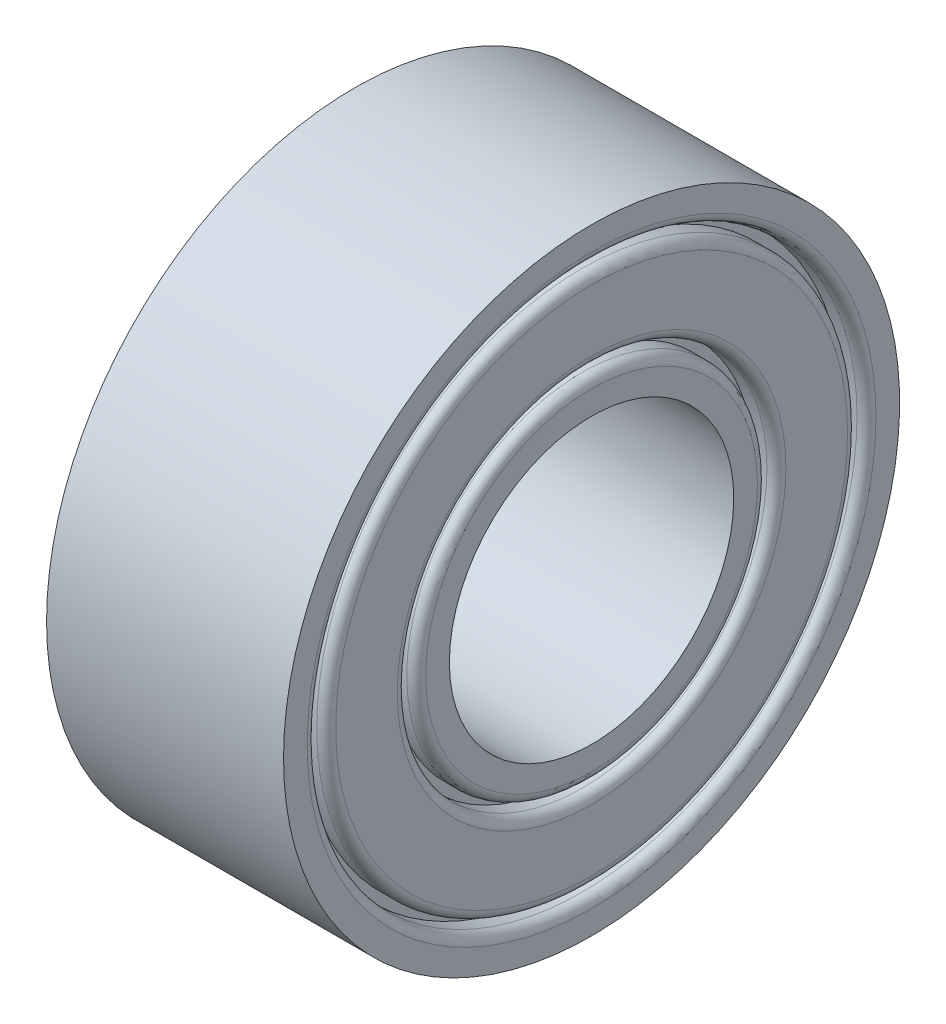
ISO-10303-21;
HEADER;
FILE_DESCRIPTION(('STEP AP214'),'2;1');
FILE_NAME('part.step','',(''),(''),'','','');
FILE_SCHEMA(('AUTOMOTIVE_DESIGN { 1 0 10303 214 1 1 1 1 }'));
ENDSEC;
DATA;
#1=APPLICATION_CONTEXT('core data for automotive mechanical design processes');
#2=APPLICATION_PROTOCOL_DEFINITION('international standard','automotive_design',2000,#1);
#3=PRODUCT_CONTEXT('',#1,'mechanical');
#4=PRODUCT('Part','Part','',(#3));
#5=PRODUCT_RELATED_PRODUCT_CATEGORY('part','',(#4));
#6=PRODUCT_DEFINITION_FORMATION('','',#4);
#7=PRODUCT_DEFINITION_CONTEXT('part definition',#1,'design');
#8=PRODUCT_DEFINITION('design','',#6,#7);
#9=PRODUCT_DEFINITION_SHAPE('','',#8);
#10=(LENGTH_UNIT() NAMED_UNIT(*) SI_UNIT(.MILLI.,.METRE.));
#11=(NAMED_UNIT(*) PLANE_ANGLE_UNIT() SI_UNIT($,.RADIAN.));
#12=(NAMED_UNIT(*) SI_UNIT($,.STERADIAN.) SOLID_ANGLE_UNIT());
#13=UNCERTAINTY_MEASURE_WITH_UNIT(LENGTH_MEASURE(1.E-05),#10,'distance_accuracy_value','');
#14=(GEOMETRIC_REPRESENTATION_CONTEXT(3) GLOBAL_UNCERTAINTY_ASSIGNED_CONTEXT((#13)) GLOBAL_UNIT_ASSIGNED_CONTEXT((#10,
#11,#12)) REPRESENTATION_CONTEXT('',''));
#15=CARTESIAN_POINT('',(0.,0.,0.));
#16=DIRECTION('',(0.,0.,1.));
#17=DIRECTION('',(1.,0.,0.));
#18=AXIS2_PLACEMENT_3D('',#15,#16,#17);
#19=CARTESIAN_POINT('',(-2.5,0.,0.));
#20=DIRECTION('',(1.,0.,0.));
#21=DIRECTION('',(0.,0.,-1.));
#22=AXIS2_PLACEMENT_3D('',#19,#20,#21);
#23=CYLINDRICAL_SURFACE('',#22,3.);
#24=CARTESIAN_POINT('',(-2.5,0.,0.));
#25=DIRECTION('',(1.,0.,0.));
#26=DIRECTION('',(0.,0.,-1.));
#27=AXIS2_PLACEMENT_3D('',#24,#25,#26);
#28=CIRCLE('',#27,3.);
#29=CARTESIAN_POINT('',(-2.5,0.,-3.));
#30=VERTEX_POINT('',#29);
#31=EDGE_CURVE('E89',#30,#30,#28,.T.);
#32=ORIENTED_EDGE('',*,*,#31,.F.);
#33=EDGE_LOOP('',(#32));
#34=FACE_BOUND('',#33,.T.);
#35=CARTESIAN_POINT('',(2.5,0.,0.));
#36=DIRECTION('',(1.,0.,0.));
#37=DIRECTION('',(0.,0.,-1.));
#38=AXIS2_PLACEMENT_3D('',#35,#36,#37);
#39=CIRCLE('',#38,3.);
#40=CARTESIAN_POINT('',(2.5,0.,-3.));
#41=VERTEX_POINT('',#40);
#42=EDGE_CURVE('E92',#41,#41,#39,.F.);
#43=ORIENTED_EDGE('',*,*,#42,.F.);
#44=EDGE_LOOP('',(#43));
#45=FACE_BOUND('',#44,.T.);
#46=ADVANCED_FACE('F15',(#34,#45),#23,.F.);
#47=CARTESIAN_POINT('',(2.5,-3.57,3.5));
#48=DIRECTION('',(1.,0.,0.));
#49=DIRECTION('',(0.,0.,-1.));
#50=AXIS2_PLACEMENT_3D('',#47,#48,#49);
#51=PLANE('',#50);
#52=ORIENTED_EDGE('',*,*,#42,.T.);
#53=EDGE_LOOP('',(#52));
#54=FACE_BOUND('',#53,.T.);
#55=CARTESIAN_POINT('',(2.5,0.,0.));
#56=DIRECTION('',(1.,0.,0.));
#57=DIRECTION('',(0.,0.,-1.));
#58=AXIS2_PLACEMENT_3D('',#55,#56,#57);
#59=CIRCLE('',#58,3.50000000000271);
#60=CARTESIAN_POINT('',(2.5,0.,-3.50000000000271));
#61=VERTEX_POINT('',#60);
#62=EDGE_CURVE('E86',#61,#61,#59,.F.);
#63=ORIENTED_EDGE('',*,*,#62,.F.);
#64=EDGE_LOOP('',(#63));
#65=FACE_BOUND('',#64,.T.);
#66=ADVANCED_FACE('F127',(#54,#65),#51,.T.);
#67=CARTESIAN_POINT('',(-2.5,-3.57,-3.57));
#68=DIRECTION('',(-1.,0.,0.));
#69=DIRECTION('',(0.,0.,1.));
#70=AXIS2_PLACEMENT_3D('',#67,#68,#69);
#71=PLANE('',#70);
#72=ORIENTED_EDGE('',*,*,#31,.T.);
#73=EDGE_LOOP('',(#72));
#74=FACE_BOUND('',#73,.T.);
#75=CARTESIAN_POINT('',(-2.5,0.,0.));
#76=DIRECTION('',(1.,0.,0.));
#77=DIRECTION('',(0.,0.,-1.));
#78=AXIS2_PLACEMENT_3D('',#75,#76,#77);
#79=CIRCLE('',#78,3.5);
#80=CARTESIAN_POINT('',(-2.5,0.,-3.5));
#81=VERTEX_POINT('',#80);
#82=EDGE_CURVE('E82',#81,#81,#79,.T.);
#83=ORIENTED_EDGE('',*,*,#82,.F.);
#84=EDGE_LOOP('',(#83));
#85=FACE_BOUND('',#84,.T.);
#86=ADVANCED_FACE('F123',(#74,#85),#71,.T.);
#87=CARTESIAN_POINT('',(2.29999999999997,0.,0.));
#88=DIRECTION('',(1.,0.,0.));
#89=DIRECTION('',(0.,0.,-1.));
#90=AXIS2_PLACEMENT_3D('',#87,#88,#89);
#91=TOROIDAL_SURFACE('',#90,3.49999999999997,0.200000000000031);
#92=CARTESIAN_POINT('',(2.3,0.,0.));
#93=DIRECTION('',(-1.,0.,0.));
#94=DIRECTION('',(0.,0.,1.));
#95=AXIS2_PLACEMENT_3D('',#92,#93,#94);
#96=CIRCLE('',#95,3.7);
#97=CARTESIAN_POINT('',(2.3,0.,3.7));
#98=VERTEX_POINT('',#97);
#99=EDGE_CURVE('E85',#98,#98,#96,.T.);
#100=ORIENTED_EDGE('',*,*,#99,.F.);
#101=EDGE_LOOP('',(#100));
#102=FACE_BOUND('',#101,.T.);
#103=ORIENTED_EDGE('',*,*,#62,.T.);
#104=EDGE_LOOP('',(#103));
#105=FACE_BOUND('',#104,.T.);
#106=ADVANCED_FACE('F119',(#102,#105),#91,.T.);
#107=CARTESIAN_POINT('',(-2.29999999999997,0.,0.));
#108=DIRECTION('',(1.,0.,0.));
#109=DIRECTION('',(0.,0.,-1.));
#110=AXIS2_PLACEMENT_3D('',#107,#108,#109);
#111=TOROIDAL_SURFACE('',#110,3.49999999999997,0.20000000000003);
#112=ORIENTED_EDGE('',*,*,#82,.T.);
#113=EDGE_LOOP('',(#112));
#114=FACE_BOUND('',#113,.T.);
#115=CARTESIAN_POINT('',(-2.3,0.,0.));
#116=DIRECTION('',(1.,0.,0.));
#117=DIRECTION('',(0.,0.,-1.));
#118=AXIS2_PLACEMENT_3D('',#115,#116,#117);
#119=CIRCLE('',#118,3.7);
#120=CARTESIAN_POINT('',(-2.3,0.,-3.7));
#121=VERTEX_POINT('',#120);
#122=EDGE_CURVE('E81',#121,#121,#119,.T.);
#123=ORIENTED_EDGE('',*,*,#122,.F.);
#124=EDGE_LOOP('',(#123));
#125=FACE_BOUND('',#124,.T.);
#126=ADVANCED_FACE('F122',(#114,#125),#111,.T.);
#127=CARTESIAN_POINT('',(2.3,0.,0.));
#128=DIRECTION('',(-1.,0.,0.));
#129=DIRECTION('',(0.,0.,1.));
#130=AXIS2_PLACEMENT_3D('',#127,#128,#129);
#131=CYLINDRICAL_SURFACE('',#130,3.7);
#132=CARTESIAN_POINT('',(2.,0.,0.));
#133=DIRECTION('',(-1.,0.,0.));
#134=DIRECTION('',(0.,0.,1.));
#135=AXIS2_PLACEMENT_3D('',#132,#133,#134);
#136=CIRCLE('',#135,3.7);
#137=CARTESIAN_POINT('',(2.,0.,3.7));
#138=VERTEX_POINT('',#137);
#139=EDGE_CURVE('E78',#138,#138,#136,.T.);
#140=ORIENTED_EDGE('',*,*,#139,.F.);
#141=EDGE_LOOP('',(#140));
#142=FACE_BOUND('',#141,.T.);
#143=ORIENTED_EDGE('',*,*,#99,.T.);
#144=EDGE_LOOP('',(#143));
#145=FACE_BOUND('',#144,.T.);
#146=ADVANCED_FACE('F117',(#142,#145),#131,.T.);
#147=CARTESIAN_POINT('',(-2.,0.,0.));
#148=DIRECTION('',(-1.,0.,0.));
#149=DIRECTION('',(0.,0.,1.));
#150=AXIS2_PLACEMENT_3D('',#147,#148,#149);
#151=CYLINDRICAL_SURFACE('',#150,3.7);
#152=ORIENTED_EDGE('',*,*,#122,.T.);
#153=EDGE_LOOP('',(#152));
#154=FACE_BOUND('',#153,.T.);
#155=CARTESIAN_POINT('',(-2.,0.,0.));
#156=DIRECTION('',(-1.,0.,0.));
#157=DIRECTION('',(0.,0.,1.));
#158=AXIS2_PLACEMENT_3D('',#155,#156,#157);
#159=CIRCLE('',#158,3.7);
#160=CARTESIAN_POINT('',(-2.,0.,3.7));
#161=VERTEX_POINT('',#160);
#162=EDGE_CURVE('E75',#161,#161,#159,.F.);
#163=ORIENTED_EDGE('',*,*,#162,.F.);
#164=EDGE_LOOP('',(#163));
#165=FACE_BOUND('',#164,.T.);
#166=ADVANCED_FACE('F227',(#154,#165),#151,.T.);
#167=CARTESIAN_POINT('',(2.,-3.9,3.978));
#168=DIRECTION('',(1.,0.,0.));
#169=DIRECTION('',(0.,0.,-1.));
#170=AXIS2_PLACEMENT_3D('',#167,#168,#169);
#171=PLANE('',#170);
#172=ORIENTED_EDGE('',*,*,#139,.T.);
#173=EDGE_LOOP('',(#172));
#174=FACE_BOUND('',#173,.T.);
#175=CARTESIAN_POINT('',(2.,0.,0.));
#176=DIRECTION('',(1.,0.,0.));
#177=DIRECTION('',(0.,0.,-1.));
#178=AXIS2_PLACEMENT_3D('',#175,#176,#177);
#179=CIRCLE('',#178,3.9);
#180=CARTESIAN_POINT('',(2.,0.,-3.9));
#181=VERTEX_POINT('',#180);
#182=EDGE_CURVE('E72',#181,#181,#179,.F.);
#183=ORIENTED_EDGE('',*,*,#182,.F.);
#184=EDGE_LOOP('',(#183));
#185=FACE_BOUND('',#184,.T.);
#186=ADVANCED_FACE('F223',(#174,#185),#171,.T.);
#187=CARTESIAN_POINT('',(-2.,-3.9,-3.978));
#188=DIRECTION('',(-1.,0.,0.));
#189=DIRECTION('',(0.,0.,1.));
#190=AXIS2_PLACEMENT_3D('',#187,#188,#189);
#191=PLANE('',#190);
#192=ORIENTED_EDGE('',*,*,#162,.T.);
#193=EDGE_LOOP('',(#192));
#194=FACE_BOUND('',#193,.T.);
#195=CARTESIAN_POINT('',(-2.,0.,0.));
#196=DIRECTION('',(1.,0.,0.));
#197=DIRECTION('',(0.,0.,-1.));
#198=AXIS2_PLACEMENT_3D('',#195,#196,#197);
#199=CIRCLE('',#198,3.9);
#200=CARTESIAN_POINT('',(-2.,0.,-3.9));
#201=VERTEX_POINT('',#200);
#202=EDGE_CURVE('E68',#201,#201,#199,.T.);
#203=ORIENTED_EDGE('',*,*,#202,.F.);
#204=EDGE_LOOP('',(#203));
#205=FACE_BOUND('',#204,.T.);
#206=ADVANCED_FACE('F219',(#194,#205),#191,.T.);
#207=CARTESIAN_POINT('',(2.,0.,0.));
#208=DIRECTION('',(1.,0.,0.));
#209=DIRECTION('',(0.,0.,-1.));
#210=AXIS2_PLACEMENT_3D('',#207,#208,#209);
#211=CYLINDRICAL_SURFACE('',#210,3.9);
#212=ORIENTED_EDGE('',*,*,#182,.T.);
#213=EDGE_LOOP('',(#212));
#214=FACE_BOUND('',#213,.T.);
#215=CARTESIAN_POINT('',(2.29999999999997,0.,0.));
#216=DIRECTION('',(-1.,0.,0.));
#217=DIRECTION('',(0.,0.,1.));
#218=AXIS2_PLACEMENT_3D('',#215,#216,#217);
#219=CIRCLE('',#218,3.9);
#220=CARTESIAN_POINT('',(2.29999999999997,0.,3.9));
#221=VERTEX_POINT('',#220);
#222=EDGE_CURVE('E71',#221,#221,#219,.T.);
#223=ORIENTED_EDGE('',*,*,#222,.F.);
#224=EDGE_LOOP('',(#223));
#225=FACE_BOUND('',#224,.T.);
#226=ADVANCED_FACE('F215',(#214,#225),#211,.F.);
#227=CARTESIAN_POINT('',(-2.3,0.,0.));
#228=DIRECTION('',(1.,0.,0.));
#229=DIRECTION('',(0.,0.,-1.));
#230=AXIS2_PLACEMENT_3D('',#227,#228,#229);
#231=CYLINDRICAL_SURFACE('',#230,3.9);
#232=CARTESIAN_POINT('',(-2.3,0.,0.));
#233=DIRECTION('',(1.,0.,0.));
#234=DIRECTION('',(0.,0.,-1.));
#235=AXIS2_PLACEMENT_3D('',#232,#233,#234);
#236=CIRCLE('',#235,3.9);
#237=CARTESIAN_POINT('',(-2.3,0.,-3.9));
#238=VERTEX_POINT('',#237);
#239=EDGE_CURVE('E67',#238,#238,#236,.T.);
#240=ORIENTED_EDGE('',*,*,#239,.F.);
#241=EDGE_LOOP('',(#240));
#242=FACE_BOUND('',#241,.T.);
#243=ORIENTED_EDGE('',*,*,#202,.T.);
#244=EDGE_LOOP('',(#243));
#245=FACE_BOUND('',#244,.T.);
#246=ADVANCED_FACE('F211',(#242,#245),#231,.F.);
#247=CARTESIAN_POINT('',(2.29999999999997,0.,0.));
#248=DIRECTION('',(1.,0.,0.));
#249=DIRECTION('',(0.,0.,-1.));
#250=AXIS2_PLACEMENT_3D('',#247,#248,#249);
#251=TOROIDAL_SURFACE('',#250,4.10000000000003,0.20000000000003);
#252=CARTESIAN_POINT('',(2.5,0.,0.));
#253=DIRECTION('',(1.,0.,0.));
#254=DIRECTION('',(0.,0.,-1.));
#255=AXIS2_PLACEMENT_3D('',#252,#253,#254);
#256=CIRCLE('',#255,4.1);
#257=CARTESIAN_POINT('',(2.5,0.,-4.1));
#258=VERTEX_POINT('',#257);
#259=EDGE_CURVE('E64',#258,#258,#256,.F.);
#260=ORIENTED_EDGE('',*,*,#259,.F.);
#261=EDGE_LOOP('',(#260));
#262=FACE_BOUND('',#261,.T.);
#263=ORIENTED_EDGE('',*,*,#222,.T.);
#264=EDGE_LOOP('',(#263));
#265=FACE_BOUND('',#264,.T.);
#266=ADVANCED_FACE('F207',(#262,#265),#251,.T.);
#267=CARTESIAN_POINT('',(-2.29999999999997,0.,0.));
#268=DIRECTION('',(1.,0.,0.));
#269=DIRECTION('',(0.,0.,-1.));
#270=AXIS2_PLACEMENT_3D('',#267,#268,#269);
#271=TOROIDAL_SURFACE('',#270,4.10000000000003,0.20000000000003);
#272=ORIENTED_EDGE('',*,*,#239,.T.);
#273=EDGE_LOOP('',(#272));
#274=FACE_BOUND('',#273,.T.);
#275=CARTESIAN_POINT('',(-2.5,0.,0.));
#276=DIRECTION('',(1.,0.,0.));
#277=DIRECTION('',(0.,0.,-1.));
#278=AXIS2_PLACEMENT_3D('',#275,#276,#277);
#279=CIRCLE('',#278,4.1);
#280=CARTESIAN_POINT('',(-2.5,0.,-4.1));
#281=VERTEX_POINT('',#280);
#282=EDGE_CURVE('E61',#281,#281,#279,.T.);
#283=ORIENTED_EDGE('',*,*,#282,.F.);
#284=EDGE_LOOP('',(#283));
#285=FACE_BOUND('',#284,.T.);
#286=ADVANCED_FACE('F203',(#274,#285),#271,.T.);
#287=CARTESIAN_POINT('',(2.5,-5.508,5.4));
#288=DIRECTION('',(1.,0.,0.));
#289=DIRECTION('',(0.,0.,-1.));
#290=AXIS2_PLACEMENT_3D('',#287,#288,#289);
#291=PLANE('',#290);
#292=ORIENTED_EDGE('',*,*,#259,.T.);
#293=EDGE_LOOP('',(#292));
#294=FACE_BOUND('',#293,.T.);
#295=CARTESIAN_POINT('',(2.5,0.,0.));
#296=DIRECTION('',(1.,0.,0.));
#297=DIRECTION('',(0.,0.,-1.));
#298=AXIS2_PLACEMENT_3D('',#295,#296,#297);
#299=CIRCLE('',#298,5.4);
#300=CARTESIAN_POINT('',(2.5,0.,-5.4));
#301=VERTEX_POINT('',#300);
#302=EDGE_CURVE('E58',#301,#301,#299,.F.);
#303=ORIENTED_EDGE('',*,*,#302,.F.);
#304=EDGE_LOOP('',(#303));
#305=FACE_BOUND('',#304,.T.);
#306=ADVANCED_FACE('F199',(#294,#305),#291,.T.);
#307=CARTESIAN_POINT('',(-2.5,-5.508,-5.508));
#308=DIRECTION('',(-1.,0.,0.));
#309=DIRECTION('',(0.,0.,1.));
#310=AXIS2_PLACEMENT_3D('',#307,#308,#309);
#311=PLANE('',#310);
#312=ORIENTED_EDGE('',*,*,#282,.T.);
#313=EDGE_LOOP('',(#312));
#314=FACE_BOUND('',#313,.T.);
#315=CARTESIAN_POINT('',(-2.5,0.,0.));
#316=DIRECTION('',(1.,0.,0.));
#317=DIRECTION('',(0.,0.,-1.));
#318=AXIS2_PLACEMENT_3D('',#315,#316,#317);
#319=CIRCLE('',#318,5.4);
#320=CARTESIAN_POINT('',(-2.5,0.,-5.4));
#321=VERTEX_POINT('',#320);
#322=EDGE_CURVE('E54',#321,#321,#319,.T.);
#323=ORIENTED_EDGE('',*,*,#322,.F.);
#324=EDGE_LOOP('',(#323));
#325=FACE_BOUND('',#324,.T.);
#326=ADVANCED_FACE('F195',(#314,#325),#311,.T.);
#327=CARTESIAN_POINT('',(2.29999999999997,0.,0.));
#328=DIRECTION('',(1.,0.,0.));
#329=DIRECTION('',(0.,0.,-1.));
#330=AXIS2_PLACEMENT_3D('',#327,#328,#329);
#331=TOROIDAL_SURFACE('',#330,5.39999999999997,0.20000000000003);
#332=CARTESIAN_POINT('',(2.3,0.,0.));
#333=DIRECTION('',(-1.,0.,0.));
#334=DIRECTION('',(0.,0.,1.));
#335=AXIS2_PLACEMENT_3D('',#332,#333,#334);
#336=CIRCLE('',#335,5.6);
#337=CARTESIAN_POINT('',(2.3,0.,5.6));
#338=VERTEX_POINT('',#337);
#339=EDGE_CURVE('E57',#338,#338,#336,.T.);
#340=ORIENTED_EDGE('',*,*,#339,.F.);
#341=EDGE_LOOP('',(#340));
#342=FACE_BOUND('',#341,.T.);
#343=ORIENTED_EDGE('',*,*,#302,.T.);
#344=EDGE_LOOP('',(#343));
#345=FACE_BOUND('',#344,.T.);
#346=ADVANCED_FACE('F191',(#342,#345),#331,.T.);
#347=CARTESIAN_POINT('',(-2.29999999999997,0.,0.));
#348=DIRECTION('',(1.,0.,0.));
#349=DIRECTION('',(0.,0.,-1.));
#350=AXIS2_PLACEMENT_3D('',#347,#348,#349);
#351=TOROIDAL_SURFACE('',#350,5.39999999999997,0.200000000000029);
#352=ORIENTED_EDGE('',*,*,#322,.T.);
#353=EDGE_LOOP('',(#352));
#354=FACE_BOUND('',#353,.T.);
#355=CARTESIAN_POINT('',(-2.3,0.,0.));
#356=DIRECTION('',(1.,0.,0.));
#357=DIRECTION('',(0.,0.,-1.));
#358=AXIS2_PLACEMENT_3D('',#355,#356,#357);
#359=CIRCLE('',#358,5.6);
#360=CARTESIAN_POINT('',(-2.3,0.,-5.6));
#361=VERTEX_POINT('',#360);
#362=EDGE_CURVE('E53',#361,#361,#359,.T.);
#363=ORIENTED_EDGE('',*,*,#362,.F.);
#364=EDGE_LOOP('',(#363));
#365=FACE_BOUND('',#364,.T.);
#366=ADVANCED_FACE('F187',(#354,#365),#351,.T.);
#367=CARTESIAN_POINT('',(2.3,0.,0.));
#368=DIRECTION('',(-1.,0.,0.));
#369=DIRECTION('',(0.,0.,1.));
#370=AXIS2_PLACEMENT_3D('',#367,#368,#369);
#371=CYLINDRICAL_SURFACE('',#370,5.6);
#372=CARTESIAN_POINT('',(2.,0.,0.));
#373=DIRECTION('',(-1.,0.,0.));
#374=DIRECTION('',(0.,0.,1.));
#375=AXIS2_PLACEMENT_3D('',#372,#373,#374);
#376=CIRCLE('',#375,5.6);
#377=CARTESIAN_POINT('',(2.,0.,5.6));
#378=VERTEX_POINT('',#377);
#379=EDGE_CURVE('E50',#378,#378,#376,.T.);
#380=ORIENTED_EDGE('',*,*,#379,.F.);
#381=EDGE_LOOP('',(#380));
#382=FACE_BOUND('',#381,.T.);
#383=ORIENTED_EDGE('',*,*,#339,.T.);
#384=EDGE_LOOP('',(#383));
#385=FACE_BOUND('',#384,.T.);
#386=ADVANCED_FACE('F183',(#382,#385),#371,.T.);
#387=CARTESIAN_POINT('',(-2.,0.,0.));
#388=DIRECTION('',(-1.,0.,0.));
#389=DIRECTION('',(0.,0.,1.));
#390=AXIS2_PLACEMENT_3D('',#387,#388,#389);
#391=CYLINDRICAL_SURFACE('',#390,5.6);
#392=ORIENTED_EDGE('',*,*,#362,.T.);
#393=EDGE_LOOP('',(#392));
#394=FACE_BOUND('',#393,.T.);
#395=CARTESIAN_POINT('',(-2.,0.,0.));
#396=DIRECTION('',(-1.,0.,0.));
#397=DIRECTION('',(0.,0.,1.));
#398=AXIS2_PLACEMENT_3D('',#395,#396,#397);
#399=CIRCLE('',#398,5.6);
#400=CARTESIAN_POINT('',(-2.,0.,5.6));
#401=VERTEX_POINT('',#400);
#402=EDGE_CURVE('E47',#401,#401,#399,.F.);
#403=ORIENTED_EDGE('',*,*,#402,.F.);
#404=EDGE_LOOP('',(#403));
#405=FACE_BOUND('',#404,.T.);
#406=ADVANCED_FACE('F179',(#394,#405),#391,.T.);
#407=CARTESIAN_POINT('',(2.,-5.8,5.916));
#408=DIRECTION('',(1.,0.,0.));
#409=DIRECTION('',(0.,0.,-1.));
#410=AXIS2_PLACEMENT_3D('',#407,#408,#409);
#411=PLANE('',#410);
#412=ORIENTED_EDGE('',*,*,#379,.T.);
#413=EDGE_LOOP('',(#412));
#414=FACE_BOUND('',#413,.T.);
#415=CARTESIAN_POINT('',(2.,0.,0.));
#416=DIRECTION('',(1.,0.,0.));
#417=DIRECTION('',(0.,0.,-1.));
#418=AXIS2_PLACEMENT_3D('',#415,#416,#417);
#419=CIRCLE('',#418,5.8);
#420=CARTESIAN_POINT('',(2.,0.,-5.8));
#421=VERTEX_POINT('',#420);
#422=EDGE_CURVE('E44',#421,#421,#419,.F.);
#423=ORIENTED_EDGE('',*,*,#422,.F.);
#424=EDGE_LOOP('',(#423));
#425=FACE_BOUND('',#424,.T.);
#426=ADVANCED_FACE('F175',(#414,#425),#411,.T.);
#427=CARTESIAN_POINT('',(-2.,-5.8,-5.916));
#428=DIRECTION('',(-1.,0.,0.));
#429=DIRECTION('',(0.,0.,1.));
#430=AXIS2_PLACEMENT_3D('',#427,#428,#429);
#431=PLANE('',#430);
#432=ORIENTED_EDGE('',*,*,#402,.T.);
#433=EDGE_LOOP('',(#432));
#434=FACE_BOUND('',#433,.T.);
#435=CARTESIAN_POINT('',(-2.,0.,0.));
#436=DIRECTION('',(1.,0.,0.));
#437=DIRECTION('',(0.,0.,-1.));
#438=AXIS2_PLACEMENT_3D('',#435,#436,#437);
#439=CIRCLE('',#438,5.8);
#440=CARTESIAN_POINT('',(-2.,0.,-5.8));
#441=VERTEX_POINT('',#440);
#442=EDGE_CURVE('E40',#441,#441,#439,.T.);
#443=ORIENTED_EDGE('',*,*,#442,.F.);
#444=EDGE_LOOP('',(#443));
#445=FACE_BOUND('',#444,.T.);
#446=ADVANCED_FACE('F171',(#434,#445),#431,.T.);
#447=CARTESIAN_POINT('',(2.,0.,0.));
#448=DIRECTION('',(1.,0.,0.));
#449=DIRECTION('',(0.,0.,-1.));
#450=AXIS2_PLACEMENT_3D('',#447,#448,#449);
#451=CYLINDRICAL_SURFACE('',#450,5.8);
#452=ORIENTED_EDGE('',*,*,#422,.T.);
#453=EDGE_LOOP('',(#452));
#454=FACE_BOUND('',#453,.T.);
#455=CARTESIAN_POINT('',(2.29999999999997,0.,0.));
#456=DIRECTION('',(-1.,0.,0.));
#457=DIRECTION('',(0.,0.,1.));
#458=AXIS2_PLACEMENT_3D('',#455,#456,#457);
#459=CIRCLE('',#458,5.8);
#460=CARTESIAN_POINT('',(2.29999999999997,0.,5.8));
#461=VERTEX_POINT('',#460);
#462=EDGE_CURVE('E43',#461,#461,#459,.T.);
#463=ORIENTED_EDGE('',*,*,#462,.F.);
#464=EDGE_LOOP('',(#463));
#465=FACE_BOUND('',#464,.T.);
#466=ADVANCED_FACE('F167',(#454,#465),#451,.F.);
#467=CARTESIAN_POINT('',(-2.3,0.,0.));
#468=DIRECTION('',(1.,0.,0.));
#469=DIRECTION('',(0.,0.,-1.));
#470=AXIS2_PLACEMENT_3D('',#467,#468,#469);
#471=CYLINDRICAL_SURFACE('',#470,5.8);
#472=CARTESIAN_POINT('',(-2.3,0.,0.));
#473=DIRECTION('',(1.,0.,0.));
#474=DIRECTION('',(0.,0.,-1.));
#475=AXIS2_PLACEMENT_3D('',#472,#473,#474);
#476=CIRCLE('',#475,5.8);
#477=CARTESIAN_POINT('',(-2.3,0.,-5.8));
#478=VERTEX_POINT('',#477);
#479=EDGE_CURVE('E39',#478,#478,#476,.T.);
#480=ORIENTED_EDGE('',*,*,#479,.F.);
#481=EDGE_LOOP('',(#480));
#482=FACE_BOUND('',#481,.T.);
#483=ORIENTED_EDGE('',*,*,#442,.T.);
#484=EDGE_LOOP('',(#483));
#485=FACE_BOUND('',#484,.T.);
#486=ADVANCED_FACE('F163',(#482,#485),#471,.F.);
#487=CARTESIAN_POINT('',(2.29999999999997,0.,0.));
#488=DIRECTION('',(1.,0.,0.));
#489=DIRECTION('',(0.,0.,-1.));
#490=AXIS2_PLACEMENT_3D('',#487,#488,#489);
#491=TOROIDAL_SURFACE('',#490,6.00000000000003,0.20000000000003);
#492=CARTESIAN_POINT('',(2.5,0.,0.));
#493=DIRECTION('',(1.,0.,0.));
#494=DIRECTION('',(0.,0.,-1.));
#495=AXIS2_PLACEMENT_3D('',#492,#493,#494);
#496=CIRCLE('',#495,6.);
#497=CARTESIAN_POINT('',(2.5,0.,-6.));
#498=VERTEX_POINT('',#497);
#499=EDGE_CURVE('E36',#498,#498,#496,.F.);
#500=ORIENTED_EDGE('',*,*,#499,.F.);
#501=EDGE_LOOP('',(#500));
#502=FACE_BOUND('',#501,.T.);
#503=ORIENTED_EDGE('',*,*,#462,.T.);
#504=EDGE_LOOP('',(#503));
#505=FACE_BOUND('',#504,.T.);
#506=ADVANCED_FACE('F157',(#502,#505),#491,.T.);
#507=CARTESIAN_POINT('',(-2.29999999999997,0.,0.));
#508=DIRECTION('',(1.,0.,0.));
#509=DIRECTION('',(0.,0.,-1.));
#510=AXIS2_PLACEMENT_3D('',#507,#508,#509);
#511=TOROIDAL_SURFACE('',#510,6.00000000000003,0.20000000000003);
#512=ORIENTED_EDGE('',*,*,#479,.T.);
#513=EDGE_LOOP('',(#512));
#514=FACE_BOUND('',#513,.T.);
#515=CARTESIAN_POINT('',(-2.5,0.,0.));
#516=DIRECTION('',(1.,0.,0.));
#517=DIRECTION('',(0.,0.,-1.));
#518=AXIS2_PLACEMENT_3D('',#515,#516,#517);
#519=CIRCLE('',#518,6.);
#520=CARTESIAN_POINT('',(-2.5,0.,-6.));
#521=VERTEX_POINT('',#520);
#522=EDGE_CURVE('E28',#521,#521,#519,.T.);
#523=ORIENTED_EDGE('',*,*,#522,.F.);
#524=EDGE_LOOP('',(#523));
#525=FACE_BOUND('',#524,.T.);
#526=ADVANCED_FACE('F151',(#514,#525),#511,.T.);
#527=CARTESIAN_POINT('',(2.5,-6.5,6.63));
#528=DIRECTION('',(1.,0.,0.));
#529=DIRECTION('',(0.,0.,-1.));
#530=AXIS2_PLACEMENT_3D('',#527,#528,#529);
#531=PLANE('',#530);
#532=ORIENTED_EDGE('',*,*,#499,.T.);
#533=EDGE_LOOP('',(#532));
#534=FACE_BOUND('',#533,.T.);
#535=CARTESIAN_POINT('',(2.5,0.,0.));
#536=DIRECTION('',(-1.,0.,0.));
#537=DIRECTION('',(0.,0.,1.));
#538=AXIS2_PLACEMENT_3D('',#535,#536,#537);
#539=CIRCLE('',#538,6.5);
#540=CARTESIAN_POINT('',(2.5,0.,6.5));
#541=VERTEX_POINT('',#540);
#542=EDGE_CURVE('E23',#541,#541,#539,.T.);
#543=ORIENTED_EDGE('',*,*,#542,.F.);
#544=EDGE_LOOP('',(#543));
#545=FACE_BOUND('',#544,.T.);
#546=ADVANCED_FACE('F145',(#534,#545),#531,.T.);
#547=CARTESIAN_POINT('',(-2.5,-6.5,-6.63));
#548=DIRECTION('',(-1.,0.,0.));
#549=DIRECTION('',(0.,0.,1.));
#550=AXIS2_PLACEMENT_3D('',#547,#548,#549);
#551=PLANE('',#550);
#552=ORIENTED_EDGE('',*,*,#522,.T.);
#553=EDGE_LOOP('',(#552));
#554=FACE_BOUND('',#553,.T.);
#555=CARTESIAN_POINT('',(-2.5,0.,0.));
#556=DIRECTION('',(-1.,0.,0.));
#557=DIRECTION('',(0.,0.,1.));
#558=AXIS2_PLACEMENT_3D('',#555,#556,#557);
#559=CIRCLE('',#558,6.5);
#560=CARTESIAN_POINT('',(-2.5,0.,6.5));
#561=VERTEX_POINT('',#560);
#562=EDGE_CURVE('E10',#561,#561,#559,.F.);
#563=ORIENTED_EDGE('',*,*,#562,.F.);
#564=EDGE_LOOP('',(#563));
#565=FACE_BOUND('',#564,.T.);
#566=ADVANCED_FACE('F141',(#554,#565),#551,.T.);
#567=CARTESIAN_POINT('',(2.5,0.,0.));
#568=DIRECTION('',(-1.,0.,0.));
#569=DIRECTION('',(0.,0.,1.));
#570=AXIS2_PLACEMENT_3D('',#567,#568,#569);
#571=CYLINDRICAL_SURFACE('',#570,6.5);
#572=ORIENTED_EDGE('',*,*,#562,.T.);
#573=EDGE_LOOP('',(#572));
#574=FACE_BOUND('',#573,.T.);
#575=ORIENTED_EDGE('',*,*,#542,.T.);
#576=EDGE_LOOP('',(#575));
#577=FACE_BOUND('',#576,.T.);
#578=ADVANCED_FACE('F17',(#574,#577),#571,.T.);
#579=CLOSED_SHELL('',(#46,#66,#86,#106,#126,#146,#166,#186,#206,#226,#246,#266,#286,#306,#326,
#346,#366,#386,#406,#426,#446,#466,#486,#506,#526,#546,#566,#578));
#580=MANIFOLD_SOLID_BREP('B1',#579);
#581=ADVANCED_BREP_SHAPE_REPRESENTATION('',(#18,#580),#14);
#582=SHAPE_DEFINITION_REPRESENTATION(#9,#581);
ENDSEC;
END-ISO-10303-21;
